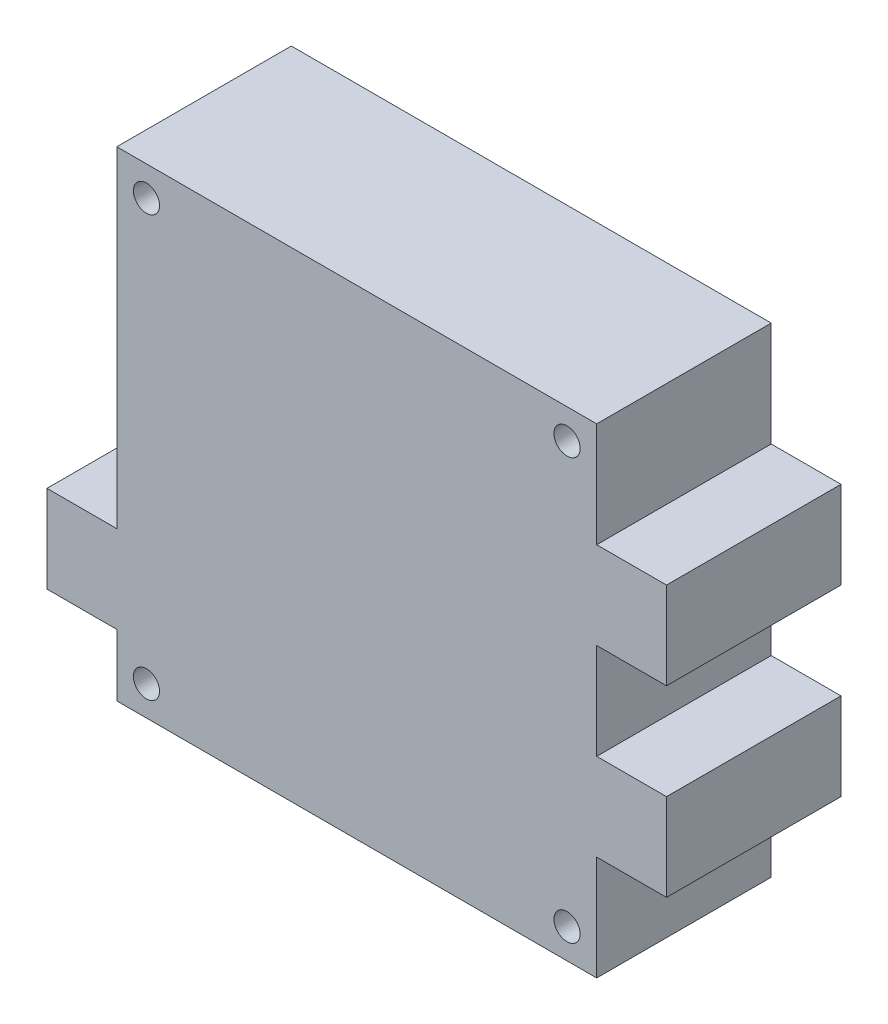
ISO-10303-21;
HEADER;
FILE_DESCRIPTION(('STEP AP214'),'2;1');
FILE_NAME('part.step','',(''),(''),'','','');
FILE_SCHEMA(('AUTOMOTIVE_DESIGN { 1 0 10303 214 1 1 1 1 }'));
ENDSEC;
DATA;
#1=APPLICATION_CONTEXT('core data for automotive mechanical design processes');
#2=APPLICATION_PROTOCOL_DEFINITION('international standard','automotive_design',2000,#1);
#3=PRODUCT_CONTEXT('',#1,'mechanical');
#4=PRODUCT('Part','Part','',(#3));
#5=PRODUCT_RELATED_PRODUCT_CATEGORY('part','',(#4));
#6=PRODUCT_DEFINITION_FORMATION('','',#4);
#7=PRODUCT_DEFINITION_CONTEXT('part definition',#1,'design');
#8=PRODUCT_DEFINITION('design','',#6,#7);
#9=PRODUCT_DEFINITION_SHAPE('','',#8);
#10=(LENGTH_UNIT() NAMED_UNIT(*) SI_UNIT(.MILLI.,.METRE.));
#11=(NAMED_UNIT(*) PLANE_ANGLE_UNIT() SI_UNIT($,.RADIAN.));
#12=(NAMED_UNIT(*) SI_UNIT($,.STERADIAN.) SOLID_ANGLE_UNIT());
#13=UNCERTAINTY_MEASURE_WITH_UNIT(LENGTH_MEASURE(1.E-05),#10,'distance_accuracy_value','');
#14=(GEOMETRIC_REPRESENTATION_CONTEXT(3) GLOBAL_UNCERTAINTY_ASSIGNED_CONTEXT((#13)) GLOBAL_UNIT_ASSIGNED_CONTEXT((#10,
#11,#12)) REPRESENTATION_CONTEXT('',''));
#15=CARTESIAN_POINT('',(0.,0.,0.));
#16=DIRECTION('',(0.,0.,1.));
#17=DIRECTION('',(1.,0.,0.));
#18=AXIS2_PLACEMENT_3D('',#15,#16,#17);
#19=CARTESIAN_POINT('',(0.,0.,20.));
#20=DIRECTION('',(0.,0.,1.));
#21=DIRECTION('',(1.,0.,0.));
#22=AXIS2_PLACEMENT_3D('',#19,#20,#21);
#23=PLANE('',#22);
#24=CARTESIAN_POINT('',(-24.1,-24.1,20.));
#25=DIRECTION('',(0.,0.,1.));
#26=DIRECTION('',(1.,0.,0.));
#27=AXIS2_PLACEMENT_3D('',#24,#25,#26);
#28=CIRCLE('',#27,1.5);
#29=CARTESIAN_POINT('',(-22.6,-24.1,20.));
#30=VERTEX_POINT('',#29);
#31=EDGE_CURVE('E347',#30,#30,#28,.T.);
#32=ORIENTED_EDGE('',*,*,#31,.F.);
#33=EDGE_LOOP('',(#32));
#34=FACE_BOUND('',#33,.T.);
#35=CARTESIAN_POINT('',(-24.1,24.1,20.));
#36=DIRECTION('',(0.,0.,1.));
#37=DIRECTION('',(1.,0.,0.));
#38=AXIS2_PLACEMENT_3D('',#35,#36,#37);
#39=CIRCLE('',#38,1.5);
#40=CARTESIAN_POINT('',(-22.6,24.1,20.));
#41=VERTEX_POINT('',#40);
#42=EDGE_CURVE('E186',#41,#41,#39,.T.);
#43=ORIENTED_EDGE('',*,*,#42,.F.);
#44=EDGE_LOOP('',(#43));
#45=FACE_BOUND('',#44,.T.);
#46=DIRECTION('',(0.,1.,0.));
#47=VECTOR('',#46,1.);
#48=CARTESIAN_POINT('',(27.5,-15.5,20.));
#49=LINE('',#48,#47);
#50=CARTESIAN_POINT('',(27.5,-27.5,20.));
#51=VERTEX_POINT('',#50);
#52=CARTESIAN_POINT('',(27.5,-15.5,20.));
#53=VERTEX_POINT('',#52);
#54=EDGE_CURVE('E213',#51,#53,#49,.T.);
#55=ORIENTED_EDGE('',*,*,#54,.T.);
#56=DIRECTION('',(1.,0.,0.));
#57=VECTOR('',#56,1.);
#58=CARTESIAN_POINT('',(27.5,-15.5,20.));
#59=LINE('',#58,#57);
#60=CARTESIAN_POINT('',(35.5,-15.5,20.));
#61=VERTEX_POINT('',#60);
#62=EDGE_CURVE('E121',#53,#61,#59,.T.);
#63=ORIENTED_EDGE('',*,*,#62,.T.);
#64=DIRECTION('',(0.,1.,0.));
#65=VECTOR('',#64,1.);
#66=CARTESIAN_POINT('',(35.5,-15.5,20.));
#67=LINE('',#66,#65);
#68=CARTESIAN_POINT('',(35.5,-5.50000000000001,20.));
#69=VERTEX_POINT('',#68);
#70=EDGE_CURVE('E252',#61,#69,#67,.T.);
#71=ORIENTED_EDGE('',*,*,#70,.T.);
#72=DIRECTION('',(-1.,0.,0.));
#73=VECTOR('',#72,1.);
#74=CARTESIAN_POINT('',(35.5,-5.50000000000001,20.));
#75=LINE('',#74,#73);
#76=CARTESIAN_POINT('',(27.5,-5.50000000000001,20.));
#77=VERTEX_POINT('',#76);
#78=EDGE_CURVE('E271',#69,#77,#75,.T.);
#79=ORIENTED_EDGE('',*,*,#78,.T.);
#80=DIRECTION('',(0.,1.,0.));
#81=VECTOR('',#80,1.);
#82=CARTESIAN_POINT('',(27.5,5.49999999999999,20.));
#83=LINE('',#82,#81);
#84=CARTESIAN_POINT('',(27.5,5.49999999999999,20.));
#85=VERTEX_POINT('',#84);
#86=EDGE_CURVE('E268',#77,#85,#83,.T.);
#87=ORIENTED_EDGE('',*,*,#86,.T.);
#88=DIRECTION('',(1.,0.,0.));
#89=VECTOR('',#88,1.);
#90=CARTESIAN_POINT('',(35.5,5.49999999999999,20.));
#91=LINE('',#90,#89);
#92=CARTESIAN_POINT('',(35.5,5.49999999999999,20.));
#93=VERTEX_POINT('',#92);
#94=EDGE_CURVE('E270',#85,#93,#91,.T.);
#95=ORIENTED_EDGE('',*,*,#94,.T.);
#96=DIRECTION('',(0.,1.,0.));
#97=VECTOR('',#96,1.);
#98=CARTESIAN_POINT('',(35.5,15.5,20.));
#99=LINE('',#98,#97);
#100=CARTESIAN_POINT('',(35.5,15.5,20.));
#101=VERTEX_POINT('',#100);
#102=EDGE_CURVE('E273',#93,#101,#99,.T.);
#103=ORIENTED_EDGE('',*,*,#102,.T.);
#104=DIRECTION('',(-1.,0.,0.));
#105=VECTOR('',#104,1.);
#106=CARTESIAN_POINT('',(27.5,15.5,20.));
#107=LINE('',#106,#105);
#108=CARTESIAN_POINT('',(27.5,15.5,20.));
#109=VERTEX_POINT('',#108);
#110=EDGE_CURVE('E279',#101,#109,#107,.T.);
#111=ORIENTED_EDGE('',*,*,#110,.T.);
#112=DIRECTION('',(0.,1.,0.));
#113=VECTOR('',#112,1.);
#114=CARTESIAN_POINT('',(27.5,27.5,20.));
#115=LINE('',#114,#113);
#116=CARTESIAN_POINT('',(27.5,27.5,20.));
#117=VERTEX_POINT('',#116);
#118=EDGE_CURVE('E281',#109,#117,#115,.T.);
#119=ORIENTED_EDGE('',*,*,#118,.T.);
#120=DIRECTION('',(-1.,0.,0.));
#121=VECTOR('',#120,1.);
#122=CARTESIAN_POINT('',(-27.5,27.5,20.));
#123=LINE('',#122,#121);
#124=CARTESIAN_POINT('',(-27.5,27.5,20.));
#125=VERTEX_POINT('',#124);
#126=EDGE_CURVE('E283',#117,#125,#123,.T.);
#127=ORIENTED_EDGE('',*,*,#126,.T.);
#128=DIRECTION('',(0.,-1.,0.));
#129=VECTOR('',#128,1.);
#130=CARTESIAN_POINT('',(-27.5,27.5,20.));
#131=LINE('',#130,#129);
#132=CARTESIAN_POINT('',(-27.5,-10.402404897082,20.));
#133=VERTEX_POINT('',#132);
#134=EDGE_CURVE('E285',#125,#133,#131,.T.);
#135=ORIENTED_EDGE('',*,*,#134,.T.);
#136=DIRECTION('',(-1.,0.,0.));
#137=VECTOR('',#136,1.);
#138=CARTESIAN_POINT('',(-35.5,-10.402404897082,20.));
#139=LINE('',#138,#137);
#140=CARTESIAN_POINT('',(-35.5,-10.402404897082,20.));
#141=VERTEX_POINT('',#140);
#142=EDGE_CURVE('E287',#133,#141,#139,.T.);
#143=ORIENTED_EDGE('',*,*,#142,.T.);
#144=DIRECTION('',(0.,-1.,0.));
#145=VECTOR('',#144,1.);
#146=CARTESIAN_POINT('',(-35.5,-20.402404897082,20.));
#147=LINE('',#146,#145);
#148=CARTESIAN_POINT('',(-35.5,-20.402404897082,20.));
#149=VERTEX_POINT('',#148);
#150=EDGE_CURVE('E164',#141,#149,#147,.T.);
#151=ORIENTED_EDGE('',*,*,#150,.T.);
#152=DIRECTION('',(1.,0.,0.));
#153=VECTOR('',#152,1.);
#154=CARTESIAN_POINT('',(-27.5,-20.402404897082,20.));
#155=LINE('',#154,#153);
#156=CARTESIAN_POINT('',(-27.5,-20.402404897082,20.));
#157=VERTEX_POINT('',#156);
#158=EDGE_CURVE('E158',#149,#157,#155,.T.);
#159=ORIENTED_EDGE('',*,*,#158,.T.);
#160=DIRECTION('',(0.,-1.,0.));
#161=VECTOR('',#160,1.);
#162=CARTESIAN_POINT('',(-27.5,-20.402404897082,20.));
#163=LINE('',#162,#161);
#164=CARTESIAN_POINT('',(-27.5,-27.5,20.));
#165=VERTEX_POINT('',#164);
#166=EDGE_CURVE('E162',#157,#165,#163,.T.);
#167=ORIENTED_EDGE('',*,*,#166,.T.);
#168=DIRECTION('',(1.,0.,0.));
#169=VECTOR('',#168,1.);
#170=CARTESIAN_POINT('',(-27.5,-27.5,20.));
#171=LINE('',#170,#169);
#172=EDGE_CURVE('E54',#165,#51,#171,.T.);
#173=ORIENTED_EDGE('',*,*,#172,.T.);
#174=EDGE_LOOP('',(#55,#63,#71,#79,#87,#95,#103,#111,#119,#127,#135,#143,#151,#159,#167,#173));
#175=FACE_BOUND('',#174,.T.);
#176=CARTESIAN_POINT('',(24.1,24.1,20.));
#177=DIRECTION('',(0.,0.,1.));
#178=DIRECTION('',(1.,0.,0.));
#179=AXIS2_PLACEMENT_3D('',#176,#177,#178);
#180=CIRCLE('',#179,1.5);
#181=CARTESIAN_POINT('',(25.6,24.1,20.));
#182=VERTEX_POINT('',#181);
#183=EDGE_CURVE('E353',#182,#182,#180,.T.);
#184=ORIENTED_EDGE('',*,*,#183,.F.);
#185=EDGE_LOOP('',(#184));
#186=FACE_BOUND('',#185,.T.);
#187=CARTESIAN_POINT('',(24.1,-24.1,20.));
#188=DIRECTION('',(0.,0.,1.));
#189=DIRECTION('',(1.,0.,0.));
#190=AXIS2_PLACEMENT_3D('',#187,#188,#189);
#191=CIRCLE('',#190,1.5);
#192=CARTESIAN_POINT('',(25.6,-24.1,20.));
#193=VERTEX_POINT('',#192);
#194=EDGE_CURVE('E338',#193,#193,#191,.T.);
#195=ORIENTED_EDGE('',*,*,#194,.F.);
#196=EDGE_LOOP('',(#195));
#197=FACE_BOUND('',#196,.T.);
#198=ADVANCED_FACE('F37',(#34,#45,#175,#186,#197),#23,.T.);
#199=CARTESIAN_POINT('',(0.,0.,0.));
#200=DIRECTION('',(0.,0.,1.));
#201=DIRECTION('',(1.,0.,0.));
#202=AXIS2_PLACEMENT_3D('',#199,#200,#201);
#203=PLANE('',#202);
#204=DIRECTION('',(0.,1.,0.));
#205=VECTOR('',#204,1.);
#206=CARTESIAN_POINT('',(27.5,-15.5,0.));
#207=LINE('',#206,#205);
#208=CARTESIAN_POINT('',(27.5,-27.5,0.));
#209=VERTEX_POINT('',#208);
#210=CARTESIAN_POINT('',(27.5,-15.5,0.));
#211=VERTEX_POINT('',#210);
#212=EDGE_CURVE('E182',#209,#211,#207,.T.);
#213=ORIENTED_EDGE('',*,*,#212,.F.);
#214=DIRECTION('',(1.,0.,0.));
#215=VECTOR('',#214,1.);
#216=CARTESIAN_POINT('',(-27.5,-27.5,0.));
#217=LINE('',#216,#215);
#218=CARTESIAN_POINT('',(-27.5,-27.5,0.));
#219=VERTEX_POINT('',#218);
#220=EDGE_CURVE('E113',#219,#209,#217,.T.);
#221=ORIENTED_EDGE('',*,*,#220,.F.);
#222=DIRECTION('',(0.,-1.,0.));
#223=VECTOR('',#222,1.);
#224=CARTESIAN_POINT('',(-27.5,-20.402404897082,0.));
#225=LINE('',#224,#223);
#226=CARTESIAN_POINT('',(-27.5,-20.402404897082,0.));
#227=VERTEX_POINT('',#226);
#228=EDGE_CURVE('E107',#227,#219,#225,.T.);
#229=ORIENTED_EDGE('',*,*,#228,.F.);
#230=DIRECTION('',(1.,0.,0.));
#231=VECTOR('',#230,1.);
#232=CARTESIAN_POINT('',(-27.5,-20.402404897082,0.));
#233=LINE('',#232,#231);
#234=CARTESIAN_POINT('',(-35.5,-20.402404897082,0.));
#235=VERTEX_POINT('',#234);
#236=EDGE_CURVE('E172',#235,#227,#233,.T.);
#237=ORIENTED_EDGE('',*,*,#236,.F.);
#238=DIRECTION('',(0.,-1.,0.));
#239=VECTOR('',#238,1.);
#240=CARTESIAN_POINT('',(-35.5,-20.402404897082,0.));
#241=LINE('',#240,#239);
#242=CARTESIAN_POINT('',(-35.5,-10.402404897082,0.));
#243=VERTEX_POINT('',#242);
#244=EDGE_CURVE('E208',#243,#235,#241,.T.);
#245=ORIENTED_EDGE('',*,*,#244,.F.);
#246=DIRECTION('',(-1.,0.,0.));
#247=VECTOR('',#246,1.);
#248=CARTESIAN_POINT('',(-35.5,-10.402404897082,0.));
#249=LINE('',#248,#247);
#250=CARTESIAN_POINT('',(-27.5,-10.402404897082,0.));
#251=VERTEX_POINT('',#250);
#252=EDGE_CURVE('E206',#251,#243,#249,.T.);
#253=ORIENTED_EDGE('',*,*,#252,.F.);
#254=DIRECTION('',(0.,-1.,0.));
#255=VECTOR('',#254,1.);
#256=CARTESIAN_POINT('',(-27.5,27.5,0.));
#257=LINE('',#256,#255);
#258=CARTESIAN_POINT('',(-27.5,27.5,0.));
#259=VERTEX_POINT('',#258);
#260=EDGE_CURVE('E204',#259,#251,#257,.T.);
#261=ORIENTED_EDGE('',*,*,#260,.F.);
#262=DIRECTION('',(-1.,0.,0.));
#263=VECTOR('',#262,1.);
#264=CARTESIAN_POINT('',(-27.5,27.5,0.));
#265=LINE('',#264,#263);
#266=CARTESIAN_POINT('',(27.5,27.5,0.));
#267=VERTEX_POINT('',#266);
#268=EDGE_CURVE('E202',#267,#259,#265,.T.);
#269=ORIENTED_EDGE('',*,*,#268,.F.);
#270=DIRECTION('',(0.,1.,0.));
#271=VECTOR('',#270,1.);
#272=CARTESIAN_POINT('',(27.5,27.5,0.));
#273=LINE('',#272,#271);
#274=CARTESIAN_POINT('',(27.5,15.5,0.));
#275=VERTEX_POINT('',#274);
#276=EDGE_CURVE('E200',#275,#267,#273,.T.);
#277=ORIENTED_EDGE('',*,*,#276,.F.);
#278=DIRECTION('',(-1.,0.,0.));
#279=VECTOR('',#278,1.);
#280=CARTESIAN_POINT('',(27.5,15.5,0.));
#281=LINE('',#280,#279);
#282=CARTESIAN_POINT('',(35.5,15.5,0.));
#283=VERTEX_POINT('',#282);
#284=EDGE_CURVE('E198',#283,#275,#281,.T.);
#285=ORIENTED_EDGE('',*,*,#284,.F.);
#286=DIRECTION('',(0.,1.,0.));
#287=VECTOR('',#286,1.);
#288=CARTESIAN_POINT('',(35.5,15.5,0.));
#289=LINE('',#288,#287);
#290=CARTESIAN_POINT('',(35.5,5.49999999999999,0.));
#291=VERTEX_POINT('',#290);
#292=EDGE_CURVE('E196',#291,#283,#289,.T.);
#293=ORIENTED_EDGE('',*,*,#292,.F.);
#294=DIRECTION('',(1.,0.,0.));
#295=VECTOR('',#294,1.);
#296=CARTESIAN_POINT('',(35.5,5.49999999999999,0.));
#297=LINE('',#296,#295);
#298=CARTESIAN_POINT('',(27.5,5.49999999999999,0.));
#299=VERTEX_POINT('',#298);
#300=EDGE_CURVE('E194',#299,#291,#297,.T.);
#301=ORIENTED_EDGE('',*,*,#300,.F.);
#302=DIRECTION('',(0.,1.,0.));
#303=VECTOR('',#302,1.);
#304=CARTESIAN_POINT('',(27.5,5.49999999999999,0.));
#305=LINE('',#304,#303);
#306=CARTESIAN_POINT('',(27.5,-5.50000000000001,0.));
#307=VERTEX_POINT('',#306);
#308=EDGE_CURVE('E192',#307,#299,#305,.T.);
#309=ORIENTED_EDGE('',*,*,#308,.F.);
#310=DIRECTION('',(-1.,0.,0.));
#311=VECTOR('',#310,1.);
#312=CARTESIAN_POINT('',(35.5,-5.50000000000001,0.));
#313=LINE('',#312,#311);
#314=CARTESIAN_POINT('',(35.5,-5.50000000000001,0.));
#315=VERTEX_POINT('',#314);
#316=EDGE_CURVE('E190',#315,#307,#313,.T.);
#317=ORIENTED_EDGE('',*,*,#316,.F.);
#318=DIRECTION('',(0.,1.,0.));
#319=VECTOR('',#318,1.);
#320=CARTESIAN_POINT('',(35.5,-15.5,0.));
#321=LINE('',#320,#319);
#322=CARTESIAN_POINT('',(35.5,-15.5,0.));
#323=VERTEX_POINT('',#322);
#324=EDGE_CURVE('E188',#323,#315,#321,.T.);
#325=ORIENTED_EDGE('',*,*,#324,.F.);
#326=DIRECTION('',(1.,0.,0.));
#327=VECTOR('',#326,1.);
#328=CARTESIAN_POINT('',(27.5,-15.5,0.));
#329=LINE('',#328,#327);
#330=EDGE_CURVE('E185',#211,#323,#329,.T.);
#331=ORIENTED_EDGE('',*,*,#330,.F.);
#332=EDGE_LOOP('',(#213,#221,#229,#237,#245,#253,#261,#269,#277,#285,#293,#301,#309,#317,#325,#331));
#333=FACE_BOUND('',#332,.T.);
#334=CARTESIAN_POINT('',(-24.1,24.1,0.));
#335=DIRECTION('',(0.,0.,1.));
#336=DIRECTION('',(1.,0.,0.));
#337=AXIS2_PLACEMENT_3D('',#334,#335,#336);
#338=CIRCLE('',#337,1.5);
#339=CARTESIAN_POINT('',(-22.6,24.1,0.));
#340=VERTEX_POINT('',#339);
#341=EDGE_CURVE('E356',#340,#340,#338,.T.);
#342=ORIENTED_EDGE('',*,*,#341,.T.);
#343=EDGE_LOOP('',(#342));
#344=FACE_BOUND('',#343,.T.);
#345=CARTESIAN_POINT('',(24.1,24.1,0.));
#346=DIRECTION('',(0.,0.,1.));
#347=DIRECTION('',(1.,0.,0.));
#348=AXIS2_PLACEMENT_3D('',#345,#346,#347);
#349=CIRCLE('',#348,1.5);
#350=CARTESIAN_POINT('',(25.6,24.1,0.));
#351=VERTEX_POINT('',#350);
#352=EDGE_CURVE('E350',#351,#351,#349,.T.);
#353=ORIENTED_EDGE('',*,*,#352,.T.);
#354=EDGE_LOOP('',(#353));
#355=FACE_BOUND('',#354,.T.);
#356=CARTESIAN_POINT('',(-24.1,-24.1,0.));
#357=DIRECTION('',(0.,0.,1.));
#358=DIRECTION('',(1.,0.,0.));
#359=AXIS2_PLACEMENT_3D('',#356,#357,#358);
#360=CIRCLE('',#359,1.5);
#361=CARTESIAN_POINT('',(-22.6,-24.1,0.));
#362=VERTEX_POINT('',#361);
#363=EDGE_CURVE('E344',#362,#362,#360,.T.);
#364=ORIENTED_EDGE('',*,*,#363,.T.);
#365=EDGE_LOOP('',(#364));
#366=FACE_BOUND('',#365,.T.);
#367=CARTESIAN_POINT('',(24.1,-24.1,0.));
#368=DIRECTION('',(0.,0.,1.));
#369=DIRECTION('',(1.,0.,0.));
#370=AXIS2_PLACEMENT_3D('',#367,#368,#369);
#371=CIRCLE('',#370,1.5);
#372=CARTESIAN_POINT('',(25.6,-24.1,0.));
#373=VERTEX_POINT('',#372);
#374=EDGE_CURVE('E341',#373,#373,#371,.T.);
#375=ORIENTED_EDGE('',*,*,#374,.T.);
#376=EDGE_LOOP('',(#375));
#377=FACE_BOUND('',#376,.T.);
#378=ADVANCED_FACE('F256',(#333,#344,#355,#366,#377),#203,.F.);
#379=CARTESIAN_POINT('',(27.5,-15.5,20.));
#380=DIRECTION('',(-1.,0.,0.));
#381=DIRECTION('',(0.,0.,1.));
#382=AXIS2_PLACEMENT_3D('',#379,#380,#381);
#383=PLANE('',#382);
#384=ORIENTED_EDGE('',*,*,#212,.T.);
#385=DIRECTION('',(0.,0.,-1.));
#386=VECTOR('',#385,1.);
#387=CARTESIAN_POINT('',(27.5,-15.5,20.));
#388=LINE('',#387,#386);
#389=EDGE_CURVE('E11',#53,#211,#388,.T.);
#390=ORIENTED_EDGE('',*,*,#389,.F.);
#391=ORIENTED_EDGE('',*,*,#54,.F.);
#392=DIRECTION('',(0.,0.,-1.));
#393=VECTOR('',#392,1.);
#394=CARTESIAN_POINT('',(27.5,-27.5,20.));
#395=LINE('',#394,#393);
#396=EDGE_CURVE('E178',#51,#209,#395,.T.);
#397=ORIENTED_EDGE('',*,*,#396,.T.);
#398=EDGE_LOOP('',(#384,#390,#391,#397));
#399=FACE_BOUND('',#398,.T.);
#400=ADVANCED_FACE('F39',(#399),#383,.F.);
#401=CARTESIAN_POINT('',(27.5,-15.5,20.));
#402=DIRECTION('',(0.,1.,0.));
#403=DIRECTION('',(0.,0.,1.));
#404=AXIS2_PLACEMENT_3D('',#401,#402,#403);
#405=PLANE('',#404);
#406=ORIENTED_EDGE('',*,*,#330,.T.);
#407=DIRECTION('',(0.,0.,-1.));
#408=VECTOR('',#407,1.);
#409=CARTESIAN_POINT('',(35.5,-15.5,20.));
#410=LINE('',#409,#408);
#411=EDGE_CURVE('E46',#61,#323,#410,.T.);
#412=ORIENTED_EDGE('',*,*,#411,.F.);
#413=ORIENTED_EDGE('',*,*,#62,.F.);
#414=ORIENTED_EDGE('',*,*,#389,.T.);
#415=EDGE_LOOP('',(#406,#412,#413,#414));
#416=FACE_BOUND('',#415,.T.);
#417=ADVANCED_FACE('F506',(#416),#405,.F.);
#418=CARTESIAN_POINT('',(35.5,-15.5,20.));
#419=DIRECTION('',(-1.,0.,0.));
#420=DIRECTION('',(0.,0.,1.));
#421=AXIS2_PLACEMENT_3D('',#418,#419,#420);
#422=PLANE('',#421);
#423=ORIENTED_EDGE('',*,*,#324,.T.);
#424=DIRECTION('',(0.,0.,-1.));
#425=VECTOR('',#424,1.);
#426=CARTESIAN_POINT('',(35.5,-5.50000000000001,20.));
#427=LINE('',#426,#425);
#428=EDGE_CURVE('E244',#69,#315,#427,.T.);
#429=ORIENTED_EDGE('',*,*,#428,.F.);
#430=ORIENTED_EDGE('',*,*,#70,.F.);
#431=ORIENTED_EDGE('',*,*,#411,.T.);
#432=EDGE_LOOP('',(#423,#429,#430,#431));
#433=FACE_BOUND('',#432,.T.);
#434=ADVANCED_FACE('F250',(#433),#422,.F.);
#435=CARTESIAN_POINT('',(35.5,-5.50000000000001,20.));
#436=DIRECTION('',(0.,-1.,0.));
#437=DIRECTION('',(1.,0.,0.));
#438=AXIS2_PLACEMENT_3D('',#435,#436,#437);
#439=PLANE('',#438);
#440=ORIENTED_EDGE('',*,*,#316,.T.);
#441=DIRECTION('',(0.,0.,-1.));
#442=VECTOR('',#441,1.);
#443=CARTESIAN_POINT('',(27.5,-5.50000000000001,20.));
#444=LINE('',#443,#442);
#445=EDGE_CURVE('E241',#77,#307,#444,.T.);
#446=ORIENTED_EDGE('',*,*,#445,.F.);
#447=ORIENTED_EDGE('',*,*,#78,.F.);
#448=ORIENTED_EDGE('',*,*,#428,.T.);
#449=EDGE_LOOP('',(#440,#446,#447,#448));
#450=FACE_BOUND('',#449,.T.);
#451=ADVANCED_FACE('F262',(#450),#439,.F.);
#452=CARTESIAN_POINT('',(27.5,5.49999999999999,20.));
#453=DIRECTION('',(-1.,0.,0.));
#454=DIRECTION('',(0.,0.,1.));
#455=AXIS2_PLACEMENT_3D('',#452,#453,#454);
#456=PLANE('',#455);
#457=ORIENTED_EDGE('',*,*,#308,.T.);
#458=DIRECTION('',(0.,0.,-1.));
#459=VECTOR('',#458,1.);
#460=CARTESIAN_POINT('',(27.5,5.49999999999999,20.));
#461=LINE('',#460,#459);
#462=EDGE_CURVE('E238',#85,#299,#461,.T.);
#463=ORIENTED_EDGE('',*,*,#462,.F.);
#464=ORIENTED_EDGE('',*,*,#86,.F.);
#465=ORIENTED_EDGE('',*,*,#445,.T.);
#466=EDGE_LOOP('',(#457,#463,#464,#465));
#467=FACE_BOUND('',#466,.T.);
#468=ADVANCED_FACE('F266',(#467),#456,.F.);
#469=CARTESIAN_POINT('',(35.5,5.49999999999999,20.));
#470=DIRECTION('',(0.,1.,0.));
#471=DIRECTION('',(-1.,0.,0.));
#472=AXIS2_PLACEMENT_3D('',#469,#470,#471);
#473=PLANE('',#472);
#474=ORIENTED_EDGE('',*,*,#300,.T.);
#475=DIRECTION('',(0.,0.,-1.));
#476=VECTOR('',#475,1.);
#477=CARTESIAN_POINT('',(35.5,5.49999999999999,20.));
#478=LINE('',#477,#476);
#479=EDGE_CURVE('E235',#93,#291,#478,.T.);
#480=ORIENTED_EDGE('',*,*,#479,.F.);
#481=ORIENTED_EDGE('',*,*,#94,.F.);
#482=ORIENTED_EDGE('',*,*,#462,.T.);
#483=EDGE_LOOP('',(#474,#480,#481,#482));
#484=FACE_BOUND('',#483,.T.);
#485=ADVANCED_FACE('F471',(#484),#473,.F.);
#486=CARTESIAN_POINT('',(35.5,15.5,20.));
#487=DIRECTION('',(-1.,0.,0.));
#488=DIRECTION('',(0.,0.,1.));
#489=AXIS2_PLACEMENT_3D('',#486,#487,#488);
#490=PLANE('',#489);
#491=ORIENTED_EDGE('',*,*,#292,.T.);
#492=DIRECTION('',(0.,0.,-1.));
#493=VECTOR('',#492,1.);
#494=CARTESIAN_POINT('',(35.5,15.5,20.));
#495=LINE('',#494,#493);
#496=EDGE_CURVE('E232',#101,#283,#495,.T.);
#497=ORIENTED_EDGE('',*,*,#496,.F.);
#498=ORIENTED_EDGE('',*,*,#102,.F.);
#499=ORIENTED_EDGE('',*,*,#479,.T.);
#500=EDGE_LOOP('',(#491,#497,#498,#499));
#501=FACE_BOUND('',#500,.T.);
#502=ADVANCED_FACE('F461',(#501),#490,.F.);
#503=CARTESIAN_POINT('',(27.5,15.5,20.));
#504=DIRECTION('',(0.,-1.,0.));
#505=DIRECTION('',(0.,0.,-1.));
#506=AXIS2_PLACEMENT_3D('',#503,#504,#505);
#507=PLANE('',#506);
#508=ORIENTED_EDGE('',*,*,#284,.T.);
#509=DIRECTION('',(0.,0.,-1.));
#510=VECTOR('',#509,1.);
#511=CARTESIAN_POINT('',(27.5,15.5,20.));
#512=LINE('',#511,#510);
#513=EDGE_CURVE('E229',#109,#275,#512,.T.);
#514=ORIENTED_EDGE('',*,*,#513,.F.);
#515=ORIENTED_EDGE('',*,*,#110,.F.);
#516=ORIENTED_EDGE('',*,*,#496,.T.);
#517=EDGE_LOOP('',(#508,#514,#515,#516));
#518=FACE_BOUND('',#517,.T.);
#519=ADVANCED_FACE('F451',(#518),#507,.F.);
#520=CARTESIAN_POINT('',(27.5,27.5,20.));
#521=DIRECTION('',(-1.,0.,0.));
#522=DIRECTION('',(0.,0.,1.));
#523=AXIS2_PLACEMENT_3D('',#520,#521,#522);
#524=PLANE('',#523);
#525=ORIENTED_EDGE('',*,*,#276,.T.);
#526=DIRECTION('',(0.,0.,-1.));
#527=VECTOR('',#526,1.);
#528=CARTESIAN_POINT('',(27.5,27.5,20.));
#529=LINE('',#528,#527);
#530=EDGE_CURVE('E226',#117,#267,#529,.T.);
#531=ORIENTED_EDGE('',*,*,#530,.F.);
#532=ORIENTED_EDGE('',*,*,#118,.F.);
#533=ORIENTED_EDGE('',*,*,#513,.T.);
#534=EDGE_LOOP('',(#525,#531,#532,#533));
#535=FACE_BOUND('',#534,.T.);
#536=ADVANCED_FACE('F441',(#535),#524,.F.);
#537=CARTESIAN_POINT('',(-27.5,27.5,20.));
#538=DIRECTION('',(0.,-1.,0.));
#539=DIRECTION('',(0.,0.,-1.));
#540=AXIS2_PLACEMENT_3D('',#537,#538,#539);
#541=PLANE('',#540);
#542=ORIENTED_EDGE('',*,*,#268,.T.);
#543=DIRECTION('',(0.,0.,-1.));
#544=VECTOR('',#543,1.);
#545=CARTESIAN_POINT('',(-27.5,27.5,20.));
#546=LINE('',#545,#544);
#547=EDGE_CURVE('E223',#125,#259,#546,.T.);
#548=ORIENTED_EDGE('',*,*,#547,.F.);
#549=ORIENTED_EDGE('',*,*,#126,.F.);
#550=ORIENTED_EDGE('',*,*,#530,.T.);
#551=EDGE_LOOP('',(#542,#548,#549,#550));
#552=FACE_BOUND('',#551,.T.);
#553=ADVANCED_FACE('F431',(#552),#541,.F.);
#554=CARTESIAN_POINT('',(-27.5,27.5,20.));
#555=DIRECTION('',(1.,0.,0.));
#556=DIRECTION('',(0.,1.,0.));
#557=AXIS2_PLACEMENT_3D('',#554,#555,#556);
#558=PLANE('',#557);
#559=ORIENTED_EDGE('',*,*,#260,.T.);
#560=DIRECTION('',(0.,0.,-1.));
#561=VECTOR('',#560,1.);
#562=CARTESIAN_POINT('',(-27.5,-10.402404897082,20.));
#563=LINE('',#562,#561);
#564=EDGE_CURVE('E220',#133,#251,#563,.T.);
#565=ORIENTED_EDGE('',*,*,#564,.F.);
#566=ORIENTED_EDGE('',*,*,#134,.F.);
#567=ORIENTED_EDGE('',*,*,#547,.T.);
#568=EDGE_LOOP('',(#559,#565,#566,#567));
#569=FACE_BOUND('',#568,.T.);
#570=ADVANCED_FACE('F422',(#569),#558,.F.);
#571=CARTESIAN_POINT('',(-35.5,-10.402404897082,20.));
#572=DIRECTION('',(0.,-1.,0.));
#573=DIRECTION('',(1.,0.,0.));
#574=AXIS2_PLACEMENT_3D('',#571,#572,#573);
#575=PLANE('',#574);
#576=ORIENTED_EDGE('',*,*,#252,.T.);
#577=DIRECTION('',(0.,0.,-1.));
#578=VECTOR('',#577,1.);
#579=CARTESIAN_POINT('',(-35.5,-10.402404897082,20.));
#580=LINE('',#579,#578);
#581=EDGE_CURVE('E217',#141,#243,#580,.T.);
#582=ORIENTED_EDGE('',*,*,#581,.F.);
#583=ORIENTED_EDGE('',*,*,#142,.F.);
#584=ORIENTED_EDGE('',*,*,#564,.T.);
#585=EDGE_LOOP('',(#576,#582,#583,#584));
#586=FACE_BOUND('',#585,.T.);
#587=ADVANCED_FACE('F293',(#586),#575,.F.);
#588=CARTESIAN_POINT('',(-35.5,-20.402404897082,20.));
#589=DIRECTION('',(1.,0.,0.));
#590=DIRECTION('',(0.,0.,-1.));
#591=AXIS2_PLACEMENT_3D('',#588,#589,#590);
#592=PLANE('',#591);
#593=ORIENTED_EDGE('',*,*,#244,.T.);
#594=DIRECTION('',(0.,0.,-1.));
#595=VECTOR('',#594,1.);
#596=CARTESIAN_POINT('',(-35.5,-20.402404897082,20.));
#597=LINE('',#596,#595);
#598=EDGE_CURVE('E173',#149,#235,#597,.T.);
#599=ORIENTED_EDGE('',*,*,#598,.F.);
#600=ORIENTED_EDGE('',*,*,#150,.F.);
#601=ORIENTED_EDGE('',*,*,#581,.T.);
#602=EDGE_LOOP('',(#593,#599,#600,#601));
#603=FACE_BOUND('',#602,.T.);
#604=ADVANCED_FACE('F297',(#603),#592,.F.);
#605=CARTESIAN_POINT('',(-27.5,-20.402404897082,20.));
#606=DIRECTION('',(0.,1.,0.));
#607=DIRECTION('',(0.,0.,1.));
#608=AXIS2_PLACEMENT_3D('',#605,#606,#607);
#609=PLANE('',#608);
#610=ORIENTED_EDGE('',*,*,#236,.T.);
#611=DIRECTION('',(0.,0.,-1.));
#612=VECTOR('',#611,1.);
#613=CARTESIAN_POINT('',(-27.5,-20.402404897082,20.));
#614=LINE('',#613,#612);
#615=EDGE_CURVE('E169',#157,#227,#614,.T.);
#616=ORIENTED_EDGE('',*,*,#615,.F.);
#617=ORIENTED_EDGE('',*,*,#158,.F.);
#618=ORIENTED_EDGE('',*,*,#598,.T.);
#619=EDGE_LOOP('',(#610,#616,#617,#618));
#620=FACE_BOUND('',#619,.T.);
#621=ADVANCED_FACE('F170',(#620),#609,.F.);
#622=CARTESIAN_POINT('',(-27.5,-20.402404897082,20.));
#623=DIRECTION('',(1.,0.,0.));
#624=DIRECTION('',(0.,0.,-1.));
#625=AXIS2_PLACEMENT_3D('',#622,#623,#624);
#626=PLANE('',#625);
#627=ORIENTED_EDGE('',*,*,#228,.T.);
#628=DIRECTION('',(0.,0.,-1.));
#629=VECTOR('',#628,1.);
#630=CARTESIAN_POINT('',(-27.5,-27.5,20.));
#631=LINE('',#630,#629);
#632=EDGE_CURVE('E174',#165,#219,#631,.T.);
#633=ORIENTED_EDGE('',*,*,#632,.F.);
#634=ORIENTED_EDGE('',*,*,#166,.F.);
#635=ORIENTED_EDGE('',*,*,#615,.T.);
#636=EDGE_LOOP('',(#627,#633,#634,#635));
#637=FACE_BOUND('',#636,.T.);
#638=ADVANCED_FACE('F176',(#637),#626,.F.);
#639=CARTESIAN_POINT('',(-27.5,-27.5,20.));
#640=DIRECTION('',(0.,1.,0.));
#641=DIRECTION('',(0.,0.,1.));
#642=AXIS2_PLACEMENT_3D('',#639,#640,#641);
#643=PLANE('',#642);
#644=ORIENTED_EDGE('',*,*,#220,.T.);
#645=ORIENTED_EDGE('',*,*,#396,.F.);
#646=ORIENTED_EDGE('',*,*,#172,.F.);
#647=ORIENTED_EDGE('',*,*,#632,.T.);
#648=EDGE_LOOP('',(#644,#645,#646,#647));
#649=FACE_BOUND('',#648,.T.);
#650=ADVANCED_FACE('F301',(#649),#643,.F.);
#651=CARTESIAN_POINT('',(-24.1,24.1,20.));
#652=DIRECTION('',(0.,0.,-1.));
#653=DIRECTION('',(-1.,0.,0.));
#654=AXIS2_PLACEMENT_3D('',#651,#652,#653);
#655=CYLINDRICAL_SURFACE('',#654,1.5);
#656=ORIENTED_EDGE('',*,*,#42,.T.);
#657=EDGE_LOOP('',(#656));
#658=FACE_BOUND('',#657,.T.);
#659=ORIENTED_EDGE('',*,*,#341,.F.);
#660=EDGE_LOOP('',(#659));
#661=FACE_BOUND('',#660,.T.);
#662=ADVANCED_FACE('F303',(#658,#661),#655,.F.);
#663=CARTESIAN_POINT('',(24.1,24.1,20.));
#664=DIRECTION('',(0.,0.,-1.));
#665=DIRECTION('',(-1.,0.,0.));
#666=AXIS2_PLACEMENT_3D('',#663,#664,#665);
#667=CYLINDRICAL_SURFACE('',#666,1.5);
#668=ORIENTED_EDGE('',*,*,#183,.T.);
#669=EDGE_LOOP('',(#668));
#670=FACE_BOUND('',#669,.T.);
#671=ORIENTED_EDGE('',*,*,#352,.F.);
#672=EDGE_LOOP('',(#671));
#673=FACE_BOUND('',#672,.T.);
#674=ADVANCED_FACE('F309',(#670,#673),#667,.F.);
#675=CARTESIAN_POINT('',(-24.1,-24.1,20.));
#676=DIRECTION('',(0.,0.,-1.));
#677=DIRECTION('',(-1.,0.,0.));
#678=AXIS2_PLACEMENT_3D('',#675,#676,#677);
#679=CYLINDRICAL_SURFACE('',#678,1.5);
#680=ORIENTED_EDGE('',*,*,#31,.T.);
#681=EDGE_LOOP('',(#680));
#682=FACE_BOUND('',#681,.T.);
#683=ORIENTED_EDGE('',*,*,#363,.F.);
#684=EDGE_LOOP('',(#683));
#685=FACE_BOUND('',#684,.T.);
#686=ADVANCED_FACE('F325',(#682,#685),#679,.F.);
#687=CARTESIAN_POINT('',(24.1,-24.1,20.));
#688=DIRECTION('',(0.,0.,-1.));
#689=DIRECTION('',(-1.,0.,0.));
#690=AXIS2_PLACEMENT_3D('',#687,#688,#689);
#691=CYLINDRICAL_SURFACE('',#690,1.5);
#692=ORIENTED_EDGE('',*,*,#194,.T.);
#693=EDGE_LOOP('',(#692));
#694=FACE_BOUND('',#693,.T.);
#695=ORIENTED_EDGE('',*,*,#374,.F.);
#696=EDGE_LOOP('',(#695));
#697=FACE_BOUND('',#696,.T.);
#698=ADVANCED_FACE('F329',(#694,#697),#691,.F.);
#699=CLOSED_SHELL('',(#198,#378,#400,#417,#434,#451,#468,#485,#502,#519,#536,#553,#570,#587,
#604,#621,#638,#650,#662,#674,#686,#698));
#700=MANIFOLD_SOLID_BREP('B2',#699);
#701=ADVANCED_BREP_SHAPE_REPRESENTATION('',(#18,#700),#14);
#702=SHAPE_DEFINITION_REPRESENTATION(#9,#701);
ENDSEC;
END-ISO-10303-21;
